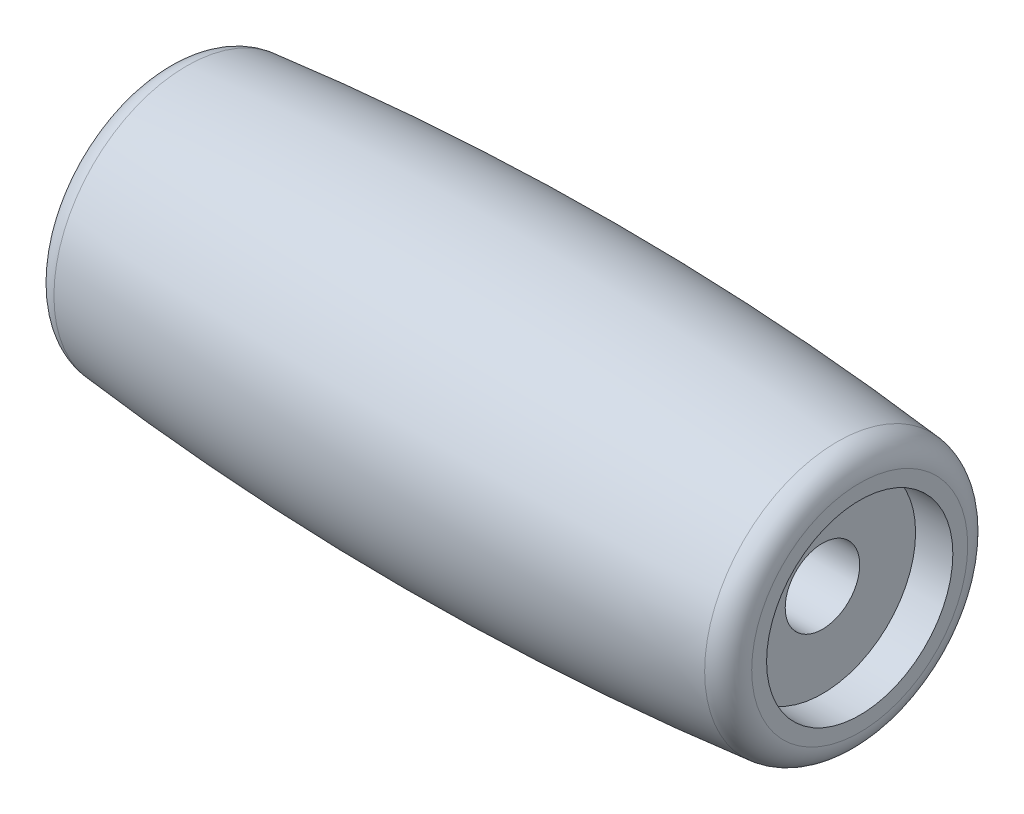
ISO-10303-21;
HEADER;
FILE_DESCRIPTION(('STEP AP214'),'2;1');
FILE_NAME('part.step','',(''),(''),'','','');
FILE_SCHEMA(('AUTOMOTIVE_DESIGN { 1 0 10303 214 1 1 1 1 }'));
ENDSEC;
DATA;
#1=APPLICATION_CONTEXT('core data for automotive mechanical design processes');
#2=APPLICATION_PROTOCOL_DEFINITION('international standard','automotive_design',2000,#1);
#3=PRODUCT_CONTEXT('',#1,'mechanical');
#4=PRODUCT('Part','Part','',(#3));
#5=PRODUCT_RELATED_PRODUCT_CATEGORY('part','',(#4));
#6=PRODUCT_DEFINITION_FORMATION('','',#4);
#7=PRODUCT_DEFINITION_CONTEXT('part definition',#1,'design');
#8=PRODUCT_DEFINITION('design','',#6,#7);
#9=PRODUCT_DEFINITION_SHAPE('','',#8);
#10=(LENGTH_UNIT() NAMED_UNIT(*) SI_UNIT(.MILLI.,.METRE.));
#11=(NAMED_UNIT(*) PLANE_ANGLE_UNIT() SI_UNIT($,.RADIAN.));
#12=(NAMED_UNIT(*) SI_UNIT($,.STERADIAN.) SOLID_ANGLE_UNIT());
#13=UNCERTAINTY_MEASURE_WITH_UNIT(LENGTH_MEASURE(1.E-05),#10,'distance_accuracy_value','');
#14=(GEOMETRIC_REPRESENTATION_CONTEXT(3) GLOBAL_UNCERTAINTY_ASSIGNED_CONTEXT((#13)) GLOBAL_UNIT_ASSIGNED_CONTEXT((#10,
#11,#12)) REPRESENTATION_CONTEXT('',''));
#15=CARTESIAN_POINT('',(0.,0.,0.));
#16=DIRECTION('',(0.,0.,1.));
#17=DIRECTION('',(1.,0.,0.));
#18=AXIS2_PLACEMENT_3D('',#15,#16,#17);
#19=CARTESIAN_POINT('',(21.25,2.55,0.));
#20=DIRECTION('',(-1.,0.,0.));
#21=DIRECTION('',(0.,0.,1.));
#22=AXIS2_PLACEMENT_3D('',#19,#20,#21);
#23=PLANE('',#22);
#24=CARTESIAN_POINT('',(21.25,0.,0.));
#25=DIRECTION('',(-1.,0.,0.));
#26=DIRECTION('',(0.,0.,1.));
#27=AXIS2_PLACEMENT_3D('',#24,#25,#26);
#28=CIRCLE('',#27,6.375);
#29=CARTESIAN_POINT('',(21.25,0.,6.375));
#30=VERTEX_POINT('',#29);
#31=EDGE_CURVE('E10',#30,#30,#28,.T.);
#32=ORIENTED_EDGE('',*,*,#31,.F.);
#33=EDGE_LOOP('',(#32));
#34=FACE_BOUND('',#33,.T.);
#35=CARTESIAN_POINT('',(21.25,0.,0.));
#36=DIRECTION('',(-1.,0.,0.));
#37=DIRECTION('',(0.,0.,1.));
#38=AXIS2_PLACEMENT_3D('',#35,#36,#37);
#39=CIRCLE('',#38,2.55);
#40=CARTESIAN_POINT('',(21.25,0.,2.55));
#41=VERTEX_POINT('',#40);
#42=EDGE_CURVE('E67',#41,#41,#39,.T.);
#43=ORIENTED_EDGE('',*,*,#42,.T.);
#44=EDGE_LOOP('',(#43));
#45=FACE_BOUND('',#44,.T.);
#46=ADVANCED_FACE('F33',(#34,#45),#23,.F.);
#47=CARTESIAN_POINT('',(0.,0.,0.));
#48=DIRECTION('',(-1.,0.,0.));
#49=DIRECTION('',(0.,0.,1.));
#50=AXIS2_PLACEMENT_3D('',#47,#48,#49);
#51=CYLINDRICAL_SURFACE('',#50,6.375);
#52=CARTESIAN_POINT('',(23.8,0.,0.));
#53=DIRECTION('',(-1.,0.,0.));
#54=DIRECTION('',(0.,0.,1.));
#55=AXIS2_PLACEMENT_3D('',#52,#53,#54);
#56=CIRCLE('',#55,6.375);
#57=CARTESIAN_POINT('',(23.8,0.,6.375));
#58=VERTEX_POINT('',#57);
#59=EDGE_CURVE('E39',#58,#58,#56,.T.);
#60=ORIENTED_EDGE('',*,*,#59,.F.);
#61=EDGE_LOOP('',(#60));
#62=FACE_BOUND('',#61,.T.);
#63=ORIENTED_EDGE('',*,*,#31,.T.);
#64=EDGE_LOOP('',(#63));
#65=FACE_BOUND('',#64,.T.);
#66=ADVANCED_FACE('F116',(#62,#65),#51,.F.);
#67=CARTESIAN_POINT('',(23.8,6.375,0.));
#68=DIRECTION('',(-1.,0.,0.));
#69=DIRECTION('',(0.,0.,1.));
#70=AXIS2_PLACEMENT_3D('',#67,#68,#69);
#71=PLANE('',#70);
#72=CARTESIAN_POINT('',(23.8,0.,0.));
#73=DIRECTION('',(-1.,0.,0.));
#74=DIRECTION('',(0.,0.,1.));
#75=AXIS2_PLACEMENT_3D('',#72,#73,#74);
#76=CIRCLE('',#75,7.3925803306086);
#77=CARTESIAN_POINT('',(23.8,0.,7.3925803306086));
#78=VERTEX_POINT('',#77);
#79=EDGE_CURVE('E43',#78,#78,#76,.T.);
#80=ORIENTED_EDGE('',*,*,#79,.F.);
#81=EDGE_LOOP('',(#80));
#82=FACE_BOUND('',#81,.T.);
#83=ORIENTED_EDGE('',*,*,#59,.T.);
#84=EDGE_LOOP('',(#83));
#85=FACE_BOUND('',#84,.T.);
#86=ADVANCED_FACE('F111',(#82,#85),#71,.F.);
#87=CARTESIAN_POINT('',(22.1,0.,0.));
#88=DIRECTION('',(-1.,0.,0.));
#89=DIRECTION('',(0.,0.,1.));
#90=AXIS2_PLACEMENT_3D('',#87,#88,#89);
#91=TOROIDAL_SURFACE('',#90,7.3925803306086,1.70000000000002);
#92=CARTESIAN_POINT('',(22.2699455302788,0.,0.));
#93=DIRECTION('',(-1.,0.,0.));
#94=DIRECTION('',(0.,0.,1.));
#95=AXIS2_PLACEMENT_3D('',#92,#93,#94);
#96=CIRCLE('',#95,9.08406444721698);
#97=CARTESIAN_POINT('',(22.2699455302788,0.,9.08406444721698));
#98=VERTEX_POINT('',#97);
#99=EDGE_CURVE('E47',#98,#98,#96,.T.);
#100=ORIENTED_EDGE('',*,*,#99,.F.);
#101=EDGE_LOOP('',(#100));
#102=FACE_BOUND('',#101,.T.);
#103=ORIENTED_EDGE('',*,*,#79,.T.);
#104=EDGE_LOOP('',(#103));
#105=FACE_BOUND('',#104,.T.);
#106=ADVANCED_FACE('F105',(#102,#105),#91,.T.);
#107=CARTESIAN_POINT('',(0.,0.,0.));
#108=DIRECTION('',(-1.,0.,0.));
#109=DIRECTION('',(0.,0.,1.));
#110=AXIS2_PLACEMENT_3D('',#107,#108,#109);
#111=DEGENERATE_TOROIDAL_SURFACE('',#110,212.570833333333,222.770833333333,.F.);
#112=CARTESIAN_POINT('',(-22.2699455302788,0.,0.));
#113=DIRECTION('',(-1.,0.,0.));
#114=DIRECTION('',(0.,0.,1.));
#115=AXIS2_PLACEMENT_3D('',#112,#113,#114);
#116=CIRCLE('',#115,9.08406444721695);
#117=CARTESIAN_POINT('',(-22.2699455302788,0.,9.08406444721695));
#118=VERTEX_POINT('',#117);
#119=EDGE_CURVE('E52',#118,#118,#116,.T.);
#120=ORIENTED_EDGE('',*,*,#119,.F.);
#121=EDGE_LOOP('',(#120));
#122=FACE_BOUND('',#121,.T.);
#123=ORIENTED_EDGE('',*,*,#99,.T.);
#124=EDGE_LOOP('',(#123));
#125=FACE_BOUND('',#124,.T.);
#126=ADVANCED_FACE('F99',(#122,#125),#111,.F.);
#127=CARTESIAN_POINT('',(-22.1,0.,0.));
#128=DIRECTION('',(-1.,0.,0.));
#129=DIRECTION('',(0.,0.,1.));
#130=AXIS2_PLACEMENT_3D('',#127,#128,#129);
#131=TOROIDAL_SURFACE('',#130,7.3925803306086,1.70000000000002);
#132=CARTESIAN_POINT('',(-23.8,0.,0.));
#133=DIRECTION('',(-1.,0.,0.));
#134=DIRECTION('',(0.,0.,1.));
#135=AXIS2_PLACEMENT_3D('',#132,#133,#134);
#136=CIRCLE('',#135,7.3925803306086);
#137=CARTESIAN_POINT('',(-23.8,0.,7.3925803306086));
#138=VERTEX_POINT('',#137);
#139=EDGE_CURVE('E55',#138,#138,#136,.T.);
#140=ORIENTED_EDGE('',*,*,#139,.F.);
#141=EDGE_LOOP('',(#140));
#142=FACE_BOUND('',#141,.T.);
#143=ORIENTED_EDGE('',*,*,#119,.T.);
#144=EDGE_LOOP('',(#143));
#145=FACE_BOUND('',#144,.T.);
#146=ADVANCED_FACE('F93',(#142,#145),#131,.T.);
#147=CARTESIAN_POINT('',(-23.8,6.375,0.));
#148=DIRECTION('',(1.,0.,0.));
#149=DIRECTION('',(0.,0.,-1.));
#150=AXIS2_PLACEMENT_3D('',#147,#148,#149);
#151=PLANE('',#150);
#152=CARTESIAN_POINT('',(-23.8,0.,0.));
#153=DIRECTION('',(-1.,0.,0.));
#154=DIRECTION('',(0.,0.,1.));
#155=AXIS2_PLACEMENT_3D('',#152,#153,#154);
#156=CIRCLE('',#155,6.375);
#157=CARTESIAN_POINT('',(-23.8,0.,6.375));
#158=VERTEX_POINT('',#157);
#159=EDGE_CURVE('E58',#158,#158,#156,.T.);
#160=ORIENTED_EDGE('',*,*,#159,.F.);
#161=EDGE_LOOP('',(#160));
#162=FACE_BOUND('',#161,.T.);
#163=ORIENTED_EDGE('',*,*,#139,.T.);
#164=EDGE_LOOP('',(#163));
#165=FACE_BOUND('',#164,.T.);
#166=ADVANCED_FACE('F87',(#162,#165),#151,.F.);
#167=CARTESIAN_POINT('',(0.,0.,0.));
#168=DIRECTION('',(-1.,0.,0.));
#169=DIRECTION('',(0.,0.,1.));
#170=AXIS2_PLACEMENT_3D('',#167,#168,#169);
#171=CYLINDRICAL_SURFACE('',#170,6.375);
#172=CARTESIAN_POINT('',(-21.25,0.,0.));
#173=DIRECTION('',(-1.,0.,0.));
#174=DIRECTION('',(0.,0.,1.));
#175=AXIS2_PLACEMENT_3D('',#172,#173,#174);
#176=CIRCLE('',#175,6.375);
#177=CARTESIAN_POINT('',(-21.25,0.,6.375));
#178=VERTEX_POINT('',#177);
#179=EDGE_CURVE('E61',#178,#178,#176,.T.);
#180=ORIENTED_EDGE('',*,*,#179,.F.);
#181=EDGE_LOOP('',(#180));
#182=FACE_BOUND('',#181,.T.);
#183=ORIENTED_EDGE('',*,*,#159,.T.);
#184=EDGE_LOOP('',(#183));
#185=FACE_BOUND('',#184,.T.);
#186=ADVANCED_FACE('F81',(#182,#185),#171,.F.);
#187=CARTESIAN_POINT('',(-21.25,2.55,0.));
#188=DIRECTION('',(1.,0.,0.));
#189=DIRECTION('',(0.,0.,-1.));
#190=AXIS2_PLACEMENT_3D('',#187,#188,#189);
#191=PLANE('',#190);
#192=CARTESIAN_POINT('',(-21.25,0.,0.));
#193=DIRECTION('',(-1.,0.,0.));
#194=DIRECTION('',(0.,0.,1.));
#195=AXIS2_PLACEMENT_3D('',#192,#193,#194);
#196=CIRCLE('',#195,2.55);
#197=CARTESIAN_POINT('',(-21.25,0.,2.55));
#198=VERTEX_POINT('',#197);
#199=EDGE_CURVE('E64',#198,#198,#196,.T.);
#200=ORIENTED_EDGE('',*,*,#199,.F.);
#201=EDGE_LOOP('',(#200));
#202=FACE_BOUND('',#201,.T.);
#203=ORIENTED_EDGE('',*,*,#179,.T.);
#204=EDGE_LOOP('',(#203));
#205=FACE_BOUND('',#204,.T.);
#206=ADVANCED_FACE('F75',(#202,#205),#191,.F.);
#207=CARTESIAN_POINT('',(0.,0.,0.));
#208=DIRECTION('',(-1.,0.,0.));
#209=DIRECTION('',(0.,0.,1.));
#210=AXIS2_PLACEMENT_3D('',#207,#208,#209);
#211=CYLINDRICAL_SURFACE('',#210,2.55);
#212=ORIENTED_EDGE('',*,*,#42,.F.);
#213=EDGE_LOOP('',(#212));
#214=FACE_BOUND('',#213,.T.);
#215=ORIENTED_EDGE('',*,*,#199,.T.);
#216=EDGE_LOOP('',(#215));
#217=FACE_BOUND('',#216,.T.);
#218=ADVANCED_FACE('F72',(#214,#217),#211,.F.);
#219=CLOSED_SHELL('',(#46,#66,#86,#106,#126,#146,#166,#186,#206,#218));
#220=MANIFOLD_SOLID_BREP('B2',#219);
#221=ADVANCED_BREP_SHAPE_REPRESENTATION('',(#18,#220),#14);
#222=SHAPE_DEFINITION_REPRESENTATION(#9,#221);
ENDSEC;
END-ISO-10303-21;
